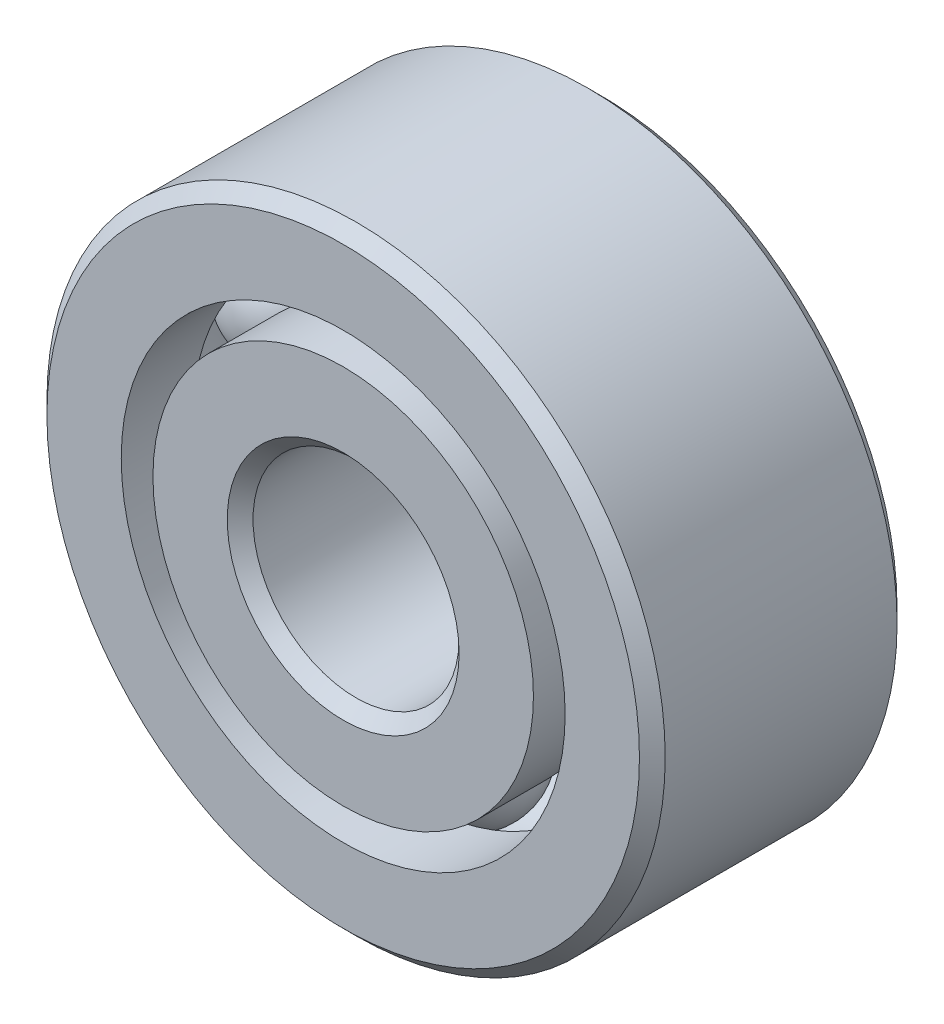
ISO-10303-21;
HEADER;
FILE_DESCRIPTION(('STEP AP214'),'2;1');
FILE_NAME('part.step','',(''),(''),'','','');
FILE_SCHEMA(('AUTOMOTIVE_DESIGN { 1 0 10303 214 1 1 1 1 }'));
ENDSEC;
DATA;
#1=APPLICATION_CONTEXT('core data for automotive mechanical design processes');
#2=APPLICATION_PROTOCOL_DEFINITION('international standard','automotive_design',2000,#1);
#3=PRODUCT_CONTEXT('',#1,'mechanical');
#4=PRODUCT('Part','Part','',(#3));
#5=PRODUCT_RELATED_PRODUCT_CATEGORY('part','',(#4));
#6=PRODUCT_DEFINITION_FORMATION('','',#4);
#7=PRODUCT_DEFINITION_CONTEXT('part definition',#1,'design');
#8=PRODUCT_DEFINITION('design','',#6,#7);
#9=PRODUCT_DEFINITION_SHAPE('','',#8);
#10=(LENGTH_UNIT() NAMED_UNIT(*) SI_UNIT(.MILLI.,.METRE.));
#11=(NAMED_UNIT(*) PLANE_ANGLE_UNIT() SI_UNIT($,.RADIAN.));
#12=(NAMED_UNIT(*) SI_UNIT($,.STERADIAN.) SOLID_ANGLE_UNIT());
#13=UNCERTAINTY_MEASURE_WITH_UNIT(LENGTH_MEASURE(1.E-05),#10,'distance_accuracy_value','');
#14=(GEOMETRIC_REPRESENTATION_CONTEXT(3) GLOBAL_UNCERTAINTY_ASSIGNED_CONTEXT((#13)) GLOBAL_UNIT_ASSIGNED_CONTEXT((#10,
#11,#12)) REPRESENTATION_CONTEXT('',''));
#15=CARTESIAN_POINT('',(0.,0.,0.));
#16=DIRECTION('',(0.,0.,1.));
#17=DIRECTION('',(1.,0.,0.));
#18=AXIS2_PLACEMENT_3D('',#15,#16,#17);
#19=CARTESIAN_POINT('',(-2.74963065701557,1.58750000000003,0.));
#20=DIRECTION('',(0.,0.,1.));
#21=DIRECTION('',(-0.866025403784433,0.50000000000001,0.));
#22=AXIS2_PLACEMENT_3D('',#19,#20,#21);
#23=SPHERICAL_SURFACE('',#22,0.915136422466876);
#24=CARTESIAN_POINT('',(-2.74963065701557,1.58750000000003,0.915136422466875));
#25=VERTEX_POINT('',#24);
#26=VERTEX_LOOP('',#25);
#27=FACE_BOUND('',#26,.T.);
#28=ADVANCED_FACE('F39',(#27),#23,.T.);
#29=CLOSED_SHELL('',(#28));
#30=MANIFOLD_SOLID_BREP('B2',#29);
#31=CARTESIAN_POINT('',(-2.74963065701561,-1.58749999999997,0.));
#32=DIRECTION('',(0.,0.,1.));
#33=DIRECTION('',(-0.866025403784443,-0.499999999999992,0.));
#34=AXIS2_PLACEMENT_3D('',#31,#32,#33);
#35=SPHERICAL_SURFACE('',#34,0.915136422466876);
#36=CARTESIAN_POINT('',(-2.74963065701561,-1.58749999999997,0.915136422466875));
#37=VERTEX_POINT('',#36);
#38=VERTEX_LOOP('',#37);
#39=FACE_BOUND('',#38,.T.);
#40=ADVANCED_FACE('F59',(#39),#35,.T.);
#41=CLOSED_SHELL('',(#40));
#42=MANIFOLD_SOLID_BREP('B6',#41);
#43=CARTESIAN_POINT('',(0.,-3.175,0.));
#44=DIRECTION('',(0.,0.,1.));
#45=DIRECTION('',(0.,-1.,0.));
#46=AXIS2_PLACEMENT_3D('',#43,#44,#45);
#47=SPHERICAL_SURFACE('',#46,0.915136422466876);
#48=CARTESIAN_POINT('',(0.,-3.175,0.915136422466875));
#49=VERTEX_POINT('',#48);
#50=VERTEX_LOOP('',#49);
#51=FACE_BOUND('',#50,.T.);
#52=ADVANCED_FACE('F79',(#51),#47,.T.);
#53=CLOSED_SHELL('',(#52));
#54=MANIFOLD_SOLID_BREP('B35',#53);
#55=CARTESIAN_POINT('',(2.74963065701559,-1.58750000000001,0.));
#56=DIRECTION('',(0.,0.,1.));
#57=DIRECTION('',(0.866025403784436,-0.500000000000004,0.));
#58=AXIS2_PLACEMENT_3D('',#55,#56,#57);
#59=SPHERICAL_SURFACE('',#58,0.915136422466876);
#60=CARTESIAN_POINT('',(2.74963065701559,-1.58750000000001,0.915136422466875));
#61=VERTEX_POINT('',#60);
#62=VERTEX_LOOP('',#61);
#63=FACE_BOUND('',#62,.T.);
#64=ADVANCED_FACE('F99',(#63),#59,.T.);
#65=CLOSED_SHELL('',(#64));
#66=MANIFOLD_SOLID_BREP('B55',#65);
#67=CARTESIAN_POINT('',(2.7496306570156,1.58749999999999,0.));
#68=DIRECTION('',(0.,0.,1.));
#69=DIRECTION('',(0.86602540378444,0.499999999999998,0.));
#70=AXIS2_PLACEMENT_3D('',#67,#68,#69);
#71=SPHERICAL_SURFACE('',#70,0.915136422466876);
#72=CARTESIAN_POINT('',(2.7496306570156,1.58749999999999,0.915136422466875));
#73=VERTEX_POINT('',#72);
#74=VERTEX_LOOP('',#73);
#75=FACE_BOUND('',#74,.T.);
#76=ADVANCED_FACE('F119',(#75),#71,.T.);
#77=CLOSED_SHELL('',(#76));
#78=MANIFOLD_SOLID_BREP('B75',#77);
#79=CARTESIAN_POINT('',(0.,3.175,0.));
#80=DIRECTION('',(0.,0.,1.));
#81=DIRECTION('',(0.,1.,0.));
#82=AXIS2_PLACEMENT_3D('',#79,#80,#81);
#83=SPHERICAL_SURFACE('',#82,0.915136422466876);
#84=CARTESIAN_POINT('',(0.,3.175,0.915136422466875));
#85=VERTEX_POINT('',#84);
#86=VERTEX_LOOP('',#85);
#87=FACE_BOUND('',#86,.T.);
#88=ADVANCED_FACE('F141',(#87),#83,.T.);
#89=CLOSED_SHELL('',(#88));
#90=MANIFOLD_SOLID_BREP('B95',#89);
#91=CARTESIAN_POINT('',(0.,2.93076923076923,1.984375));
#92=DIRECTION('',(0.,0.,-1.));
#93=DIRECTION('',(-1.,0.,0.));
#94=AXIS2_PLACEMENT_3D('',#91,#92,#93);
#95=PLANE('',#94);
#96=CARTESIAN_POINT('',(0.,0.,1.984375));
#97=DIRECTION('',(0.,0.,1.));
#98=DIRECTION('',(1.,0.,0.));
#99=AXIS2_PLACEMENT_3D('',#96,#97,#98);
#100=CIRCLE('',#99,1.7859375);
#101=CARTESIAN_POINT('',(1.7859375,0.,1.984375));
#102=VERTEX_POINT('',#101);
#103=EDGE_CURVE('E188',#102,#102,#100,.T.);
#104=ORIENTED_EDGE('',*,*,#103,.F.);
#105=EDGE_LOOP('',(#104));
#106=FACE_BOUND('',#105,.T.);
#107=CARTESIAN_POINT('',(0.,0.,1.984375));
#108=DIRECTION('',(0.,0.,1.));
#109=DIRECTION('',(1.,0.,0.));
#110=AXIS2_PLACEMENT_3D('',#107,#108,#109);
#111=CIRCLE('',#110,2.93076923076923);
#112=CARTESIAN_POINT('',(2.93076923076923,0.,1.984375));
#113=VERTEX_POINT('',#112);
#114=EDGE_CURVE('E140',#113,#113,#111,.T.);
#115=ORIENTED_EDGE('',*,*,#114,.T.);
#116=EDGE_LOOP('',(#115));
#117=FACE_BOUND('',#116,.T.);
#118=ADVANCED_FACE('F160',(#106,#117),#95,.F.);
#119=CARTESIAN_POINT('',(0.,0.,1.984375));
#120=DIRECTION('',(0.,0.,1.));
#121=DIRECTION('',(1.,0.,0.));
#122=AXIS2_PLACEMENT_3D('',#119,#120,#121);
#123=CYLINDRICAL_SURFACE('',#122,2.93076923076923);
#124=ORIENTED_EDGE('',*,*,#114,.F.);
#125=EDGE_LOOP('',(#124));
#126=FACE_BOUND('',#125,.T.);
#127=CARTESIAN_POINT('',(0.,0.,0.881944444444444));
#128=DIRECTION('',(0.,0.,1.));
#129=DIRECTION('',(1.,0.,0.));
#130=AXIS2_PLACEMENT_3D('',#127,#128,#129);
#131=CIRCLE('',#130,2.93076923076923);
#132=CARTESIAN_POINT('',(2.93076923076923,0.,0.881944444444444));
#133=VERTEX_POINT('',#132);
#134=EDGE_CURVE('E166',#133,#133,#131,.T.);
#135=ORIENTED_EDGE('',*,*,#134,.T.);
#136=EDGE_LOOP('',(#135));
#137=FACE_BOUND('',#136,.T.);
#138=ADVANCED_FACE('F195',(#126,#137),#123,.T.);
#139=CARTESIAN_POINT('',(0.,0.,0.));
#140=DIRECTION('',(0.,0.,1.));
#141=DIRECTION('',(1.,0.,0.));
#142=AXIS2_PLACEMENT_3D('',#139,#140,#141);
#143=TOROIDAL_SURFACE('',#142,3.175,0.915136422466874);
#144=ORIENTED_EDGE('',*,*,#134,.F.);
#145=EDGE_LOOP('',(#144));
#146=FACE_BOUND('',#145,.T.);
#147=CARTESIAN_POINT('',(0.,0.,-0.881944444444445));
#148=DIRECTION('',(0.,0.,1.));
#149=DIRECTION('',(1.,0.,0.));
#150=AXIS2_PLACEMENT_3D('',#147,#148,#149);
#151=CIRCLE('',#150,2.93076923076923);
#152=CARTESIAN_POINT('',(2.93076923076923,0.,-0.881944444444445));
#153=VERTEX_POINT('',#152);
#154=EDGE_CURVE('E170',#153,#153,#151,.T.);
#155=ORIENTED_EDGE('',*,*,#154,.T.);
#156=EDGE_LOOP('',(#155));
#157=FACE_BOUND('',#156,.T.);
#158=ADVANCED_FACE('F199',(#146,#157),#143,.F.);
#159=CARTESIAN_POINT('',(0.,0.,1.984375));
#160=DIRECTION('',(0.,0.,1.));
#161=DIRECTION('',(1.,0.,0.));
#162=AXIS2_PLACEMENT_3D('',#159,#160,#161);
#163=CYLINDRICAL_SURFACE('',#162,2.93076923076923);
#164=ORIENTED_EDGE('',*,*,#154,.F.);
#165=EDGE_LOOP('',(#164));
#166=FACE_BOUND('',#165,.T.);
#167=CARTESIAN_POINT('',(0.,0.,-1.984375));
#168=DIRECTION('',(0.,0.,1.));
#169=DIRECTION('',(1.,0.,0.));
#170=AXIS2_PLACEMENT_3D('',#167,#168,#169);
#171=CIRCLE('',#170,2.93076923076923);
#172=CARTESIAN_POINT('',(2.93076923076923,0.,-1.984375));
#173=VERTEX_POINT('',#172);
#174=EDGE_CURVE('E174',#173,#173,#171,.T.);
#175=ORIENTED_EDGE('',*,*,#174,.T.);
#176=EDGE_LOOP('',(#175));
#177=FACE_BOUND('',#176,.T.);
#178=ADVANCED_FACE('F204',(#166,#177),#163,.T.);
#179=CARTESIAN_POINT('',(0.,1.7859375,-1.984375));
#180=DIRECTION('',(0.,0.,1.));
#181=DIRECTION('',(1.,0.,0.));
#182=AXIS2_PLACEMENT_3D('',#179,#180,#181);
#183=PLANE('',#182);
#184=ORIENTED_EDGE('',*,*,#174,.F.);
#185=EDGE_LOOP('',(#184));
#186=FACE_BOUND('',#185,.T.);
#187=CARTESIAN_POINT('',(0.,0.,-1.984375));
#188=DIRECTION('',(0.,0.,1.));
#189=DIRECTION('',(1.,0.,0.));
#190=AXIS2_PLACEMENT_3D('',#187,#188,#189);
#191=CIRCLE('',#190,1.7859375);
#192=CARTESIAN_POINT('',(1.7859375,0.,-1.984375));
#193=VERTEX_POINT('',#192);
#194=EDGE_CURVE('E179',#193,#193,#191,.T.);
#195=ORIENTED_EDGE('',*,*,#194,.T.);
#196=EDGE_LOOP('',(#195));
#197=FACE_BOUND('',#196,.T.);
#198=ADVANCED_FACE('F210',(#186,#197),#183,.F.);
#199=CARTESIAN_POINT('',(0.,0.,-1.7859375));
#200=DIRECTION('',(0.,0.,-1.));
#201=DIRECTION('',(-1.,0.,0.));
#202=AXIS2_PLACEMENT_3D('',#199,#200,#201);
#203=CONICAL_SURFACE('',#202,1.5875,0.785398163397443);
#204=ORIENTED_EDGE('',*,*,#194,.F.);
#205=EDGE_LOOP('',(#204));
#206=FACE_BOUND('',#205,.T.);
#207=CARTESIAN_POINT('',(0.,0.,-1.7859375));
#208=DIRECTION('',(0.,0.,1.));
#209=DIRECTION('',(1.,0.,0.));
#210=AXIS2_PLACEMENT_3D('',#207,#208,#209);
#211=CIRCLE('',#210,1.5875);
#212=CARTESIAN_POINT('',(1.5875,0.,-1.7859375));
#213=VERTEX_POINT('',#212);
#214=EDGE_CURVE('E182',#213,#213,#211,.T.);
#215=ORIENTED_EDGE('',*,*,#214,.T.);
#216=EDGE_LOOP('',(#215));
#217=FACE_BOUND('',#216,.T.);
#218=ADVANCED_FACE('F214',(#206,#217),#203,.F.);
#219=CARTESIAN_POINT('',(0.,0.,1.984375));
#220=DIRECTION('',(0.,0.,1.));
#221=DIRECTION('',(1.,0.,0.));
#222=AXIS2_PLACEMENT_3D('',#219,#220,#221);
#223=CYLINDRICAL_SURFACE('',#222,1.5875);
#224=ORIENTED_EDGE('',*,*,#214,.F.);
#225=EDGE_LOOP('',(#224));
#226=FACE_BOUND('',#225,.T.);
#227=CARTESIAN_POINT('',(0.,0.,1.7859375));
#228=DIRECTION('',(0.,0.,1.));
#229=DIRECTION('',(1.,0.,0.));
#230=AXIS2_PLACEMENT_3D('',#227,#228,#229);
#231=CIRCLE('',#230,1.5875);
#232=CARTESIAN_POINT('',(1.5875,0.,1.7859375));
#233=VERTEX_POINT('',#232);
#234=EDGE_CURVE('E185',#233,#233,#231,.T.);
#235=ORIENTED_EDGE('',*,*,#234,.T.);
#236=EDGE_LOOP('',(#235));
#237=FACE_BOUND('',#236,.T.);
#238=ADVANCED_FACE('F218',(#226,#237),#223,.F.);
#239=CARTESIAN_POINT('',(0.,0.,1.984375));
#240=DIRECTION('',(0.,0.,1.));
#241=DIRECTION('',(1.,0.,0.));
#242=AXIS2_PLACEMENT_3D('',#239,#240,#241);
#243=CONICAL_SURFACE('',#242,1.7859375,0.785398163397453);
#244=ORIENTED_EDGE('',*,*,#234,.F.);
#245=EDGE_LOOP('',(#244));
#246=FACE_BOUND('',#245,.T.);
#247=ORIENTED_EDGE('',*,*,#103,.T.);
#248=EDGE_LOOP('',(#247));
#249=FACE_BOUND('',#248,.T.);
#250=ADVANCED_FACE('F192',(#246,#249),#243,.F.);
#251=CLOSED_SHELL('',(#118,#138,#158,#178,#198,#218,#238,#250));
#252=MANIFOLD_SOLID_BREP('B115',#251);
#253=CARTESIAN_POINT('',(0.,0.,1.7859375));
#254=DIRECTION('',(0.,0.,-1.));
#255=DIRECTION('',(-1.,0.,0.));
#256=AXIS2_PLACEMENT_3D('',#253,#254,#255);
#257=CONICAL_SURFACE('',#256,4.7625,0.785398163397445);
#258=CARTESIAN_POINT('',(0.,0.,1.984375));
#259=DIRECTION('',(0.,0.,1.));
#260=DIRECTION('',(1.,0.,0.));
#261=AXIS2_PLACEMENT_3D('',#258,#259,#260);
#262=CIRCLE('',#261,4.5640625);
#263=CARTESIAN_POINT('',(4.5640625,0.,1.984375));
#264=VERTEX_POINT('',#263);
#265=EDGE_CURVE('E309',#264,#264,#262,.T.);
#266=ORIENTED_EDGE('',*,*,#265,.F.);
#267=EDGE_LOOP('',(#266));
#268=FACE_BOUND('',#267,.T.);
#269=CARTESIAN_POINT('',(0.,0.,1.7859375));
#270=DIRECTION('',(0.,0.,1.));
#271=DIRECTION('',(1.,0.,0.));
#272=AXIS2_PLACEMENT_3D('',#269,#270,#271);
#273=CIRCLE('',#272,4.7625);
#274=CARTESIAN_POINT('',(4.7625,0.,1.7859375));
#275=VERTEX_POINT('',#274);
#276=EDGE_CURVE('E159',#275,#275,#273,.T.);
#277=ORIENTED_EDGE('',*,*,#276,.T.);
#278=EDGE_LOOP('',(#277));
#279=FACE_BOUND('',#278,.T.);
#280=ADVANCED_FACE('F281',(#268,#279),#257,.T.);
#281=CARTESIAN_POINT('',(0.,0.,1.984375));
#282=DIRECTION('',(0.,0.,1.));
#283=DIRECTION('',(1.,0.,0.));
#284=AXIS2_PLACEMENT_3D('',#281,#282,#283);
#285=CYLINDRICAL_SURFACE('',#284,4.7625);
#286=ORIENTED_EDGE('',*,*,#276,.F.);
#287=EDGE_LOOP('',(#286));
#288=FACE_BOUND('',#287,.T.);
#289=CARTESIAN_POINT('',(0.,0.,-1.7859375));
#290=DIRECTION('',(0.,0.,1.));
#291=DIRECTION('',(1.,0.,0.));
#292=AXIS2_PLACEMENT_3D('',#289,#290,#291);
#293=CIRCLE('',#292,4.7625);
#294=CARTESIAN_POINT('',(4.7625,0.,-1.7859375));
#295=VERTEX_POINT('',#294);
#296=EDGE_CURVE('E287',#295,#295,#293,.T.);
#297=ORIENTED_EDGE('',*,*,#296,.T.);
#298=EDGE_LOOP('',(#297));
#299=FACE_BOUND('',#298,.T.);
#300=ADVANCED_FACE('F316',(#288,#299),#285,.T.);
#301=CARTESIAN_POINT('',(0.,0.,-1.984375));
#302=DIRECTION('',(0.,0.,1.));
#303=DIRECTION('',(1.,0.,0.));
#304=AXIS2_PLACEMENT_3D('',#301,#302,#303);
#305=CONICAL_SURFACE('',#304,4.5640625,0.785398163397444);
#306=ORIENTED_EDGE('',*,*,#296,.F.);
#307=EDGE_LOOP('',(#306));
#308=FACE_BOUND('',#307,.T.);
#309=CARTESIAN_POINT('',(0.,0.,-1.984375));
#310=DIRECTION('',(0.,0.,1.));
#311=DIRECTION('',(1.,0.,0.));
#312=AXIS2_PLACEMENT_3D('',#309,#310,#311);
#313=CIRCLE('',#312,4.5640625);
#314=CARTESIAN_POINT('',(4.5640625,0.,-1.984375));
#315=VERTEX_POINT('',#314);
#316=EDGE_CURVE('E291',#315,#315,#313,.T.);
#317=ORIENTED_EDGE('',*,*,#316,.T.);
#318=EDGE_LOOP('',(#317));
#319=FACE_BOUND('',#318,.T.);
#320=ADVANCED_FACE('F320',(#308,#319),#305,.T.);
#321=CARTESIAN_POINT('',(0.,4.5640625,-1.984375));
#322=DIRECTION('',(0.,0.,1.));
#323=DIRECTION('',(1.,0.,0.));
#324=AXIS2_PLACEMENT_3D('',#321,#322,#323);
#325=PLANE('',#324);
#326=ORIENTED_EDGE('',*,*,#316,.F.);
#327=EDGE_LOOP('',(#326));
#328=FACE_BOUND('',#327,.T.);
#329=CARTESIAN_POINT('',(0.,0.,-1.984375));
#330=DIRECTION('',(0.,0.,1.));
#331=DIRECTION('',(1.,0.,0.));
#332=AXIS2_PLACEMENT_3D('',#329,#330,#331);
#333=CIRCLE('',#332,3.41923076923077);
#334=CARTESIAN_POINT('',(3.41923076923077,0.,-1.984375));
#335=VERTEX_POINT('',#334);
#336=EDGE_CURVE('E295',#335,#335,#333,.T.);
#337=ORIENTED_EDGE('',*,*,#336,.T.);
#338=EDGE_LOOP('',(#337));
#339=FACE_BOUND('',#338,.T.);
#340=ADVANCED_FACE('F325',(#328,#339),#325,.F.);
#341=CARTESIAN_POINT('',(0.,0.,1.984375));
#342=DIRECTION('',(0.,0.,1.));
#343=DIRECTION('',(1.,0.,0.));
#344=AXIS2_PLACEMENT_3D('',#341,#342,#343);
#345=CYLINDRICAL_SURFACE('',#344,3.41923076923077);
#346=ORIENTED_EDGE('',*,*,#336,.F.);
#347=EDGE_LOOP('',(#346));
#348=FACE_BOUND('',#347,.T.);
#349=CARTESIAN_POINT('',(0.,0.,-0.881944444444445));
#350=DIRECTION('',(0.,0.,1.));
#351=DIRECTION('',(1.,0.,0.));
#352=AXIS2_PLACEMENT_3D('',#349,#350,#351);
#353=CIRCLE('',#352,3.41923076923077);
#354=CARTESIAN_POINT('',(3.41923076923077,0.,-0.881944444444445));
#355=VERTEX_POINT('',#354);
#356=EDGE_CURVE('E300',#355,#355,#353,.T.);
#357=ORIENTED_EDGE('',*,*,#356,.T.);
#358=EDGE_LOOP('',(#357));
#359=FACE_BOUND('',#358,.T.);
#360=ADVANCED_FACE('F331',(#348,#359),#345,.F.);
#361=CARTESIAN_POINT('',(0.,0.,0.));
#362=DIRECTION('',(0.,0.,1.));
#363=DIRECTION('',(1.,0.,0.));
#364=AXIS2_PLACEMENT_3D('',#361,#362,#363);
#365=TOROIDAL_SURFACE('',#364,3.175,0.915136422466876);
#366=ORIENTED_EDGE('',*,*,#356,.F.);
#367=EDGE_LOOP('',(#366));
#368=FACE_BOUND('',#367,.T.);
#369=CARTESIAN_POINT('',(0.,0.,0.881944444444444));
#370=DIRECTION('',(0.,0.,1.));
#371=DIRECTION('',(1.,0.,0.));
#372=AXIS2_PLACEMENT_3D('',#369,#370,#371);
#373=CIRCLE('',#372,3.41923076923077);
#374=CARTESIAN_POINT('',(3.41923076923077,0.,0.881944444444444));
#375=VERTEX_POINT('',#374);
#376=EDGE_CURVE('E303',#375,#375,#373,.T.);
#377=ORIENTED_EDGE('',*,*,#376,.T.);
#378=EDGE_LOOP('',(#377));
#379=FACE_BOUND('',#378,.T.);
#380=ADVANCED_FACE('F335',(#368,#379),#365,.F.);
#381=CARTESIAN_POINT('',(0.,0.,1.984375));
#382=DIRECTION('',(0.,0.,1.));
#383=DIRECTION('',(1.,0.,0.));
#384=AXIS2_PLACEMENT_3D('',#381,#382,#383);
#385=CYLINDRICAL_SURFACE('',#384,3.41923076923077);
#386=ORIENTED_EDGE('',*,*,#376,.F.);
#387=EDGE_LOOP('',(#386));
#388=FACE_BOUND('',#387,.T.);
#389=CARTESIAN_POINT('',(0.,0.,1.984375));
#390=DIRECTION('',(0.,0.,1.));
#391=DIRECTION('',(1.,0.,0.));
#392=AXIS2_PLACEMENT_3D('',#389,#390,#391);
#393=CIRCLE('',#392,3.41923076923077);
#394=CARTESIAN_POINT('',(3.41923076923077,0.,1.984375));
#395=VERTEX_POINT('',#394);
#396=EDGE_CURVE('E306',#395,#395,#393,.T.);
#397=ORIENTED_EDGE('',*,*,#396,.T.);
#398=EDGE_LOOP('',(#397));
#399=FACE_BOUND('',#398,.T.);
#400=ADVANCED_FACE('F339',(#388,#399),#385,.F.);
#401=CARTESIAN_POINT('',(0.,4.5640625,1.984375));
#402=DIRECTION('',(0.,0.,-1.));
#403=DIRECTION('',(-1.,0.,0.));
#404=AXIS2_PLACEMENT_3D('',#401,#402,#403);
#405=PLANE('',#404);
#406=ORIENTED_EDGE('',*,*,#396,.F.);
#407=EDGE_LOOP('',(#406));
#408=FACE_BOUND('',#407,.T.);
#409=ORIENTED_EDGE('',*,*,#265,.T.);
#410=EDGE_LOOP('',(#409));
#411=FACE_BOUND('',#410,.T.);
#412=ADVANCED_FACE('F313',(#408,#411),#405,.F.);
#413=CLOSED_SHELL('',(#280,#300,#320,#340,#360,#380,#400,#412));
#414=MANIFOLD_SOLID_BREP('B135',#413);
#415=ADVANCED_BREP_SHAPE_REPRESENTATION('',(#18,#30,#42,#54,#66,#78,#90,#252,#414),#14);
#416=SHAPE_DEFINITION_REPRESENTATION(#9,#415);
ENDSEC;
END-ISO-10303-21;
